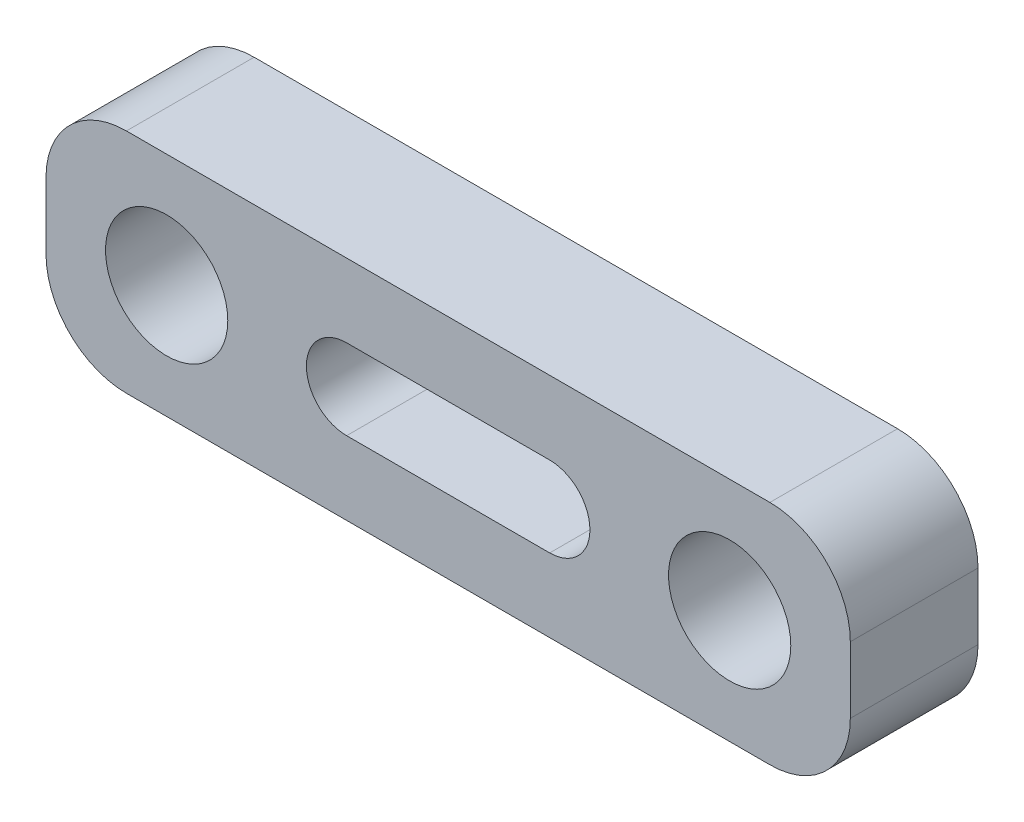
ISO-10303-21;
HEADER;
FILE_DESCRIPTION(('STEP AP214'),'2;1');
FILE_NAME('part.step','',(''),(''),'','','');
FILE_SCHEMA(('AUTOMOTIVE_DESIGN { 1 0 10303 214 1 1 1 1 }'));
ENDSEC;
DATA;
#1=APPLICATION_CONTEXT('core data for automotive mechanical design processes');
#2=APPLICATION_PROTOCOL_DEFINITION('international standard','automotive_design',2000,#1);
#3=PRODUCT_CONTEXT('',#1,'mechanical');
#4=PRODUCT('Part','Part','',(#3));
#5=PRODUCT_RELATED_PRODUCT_CATEGORY('part','',(#4));
#6=PRODUCT_DEFINITION_FORMATION('','',#4);
#7=PRODUCT_DEFINITION_CONTEXT('part definition',#1,'design');
#8=PRODUCT_DEFINITION('design','',#6,#7);
#9=PRODUCT_DEFINITION_SHAPE('','',#8);
#10=(LENGTH_UNIT() NAMED_UNIT(*) SI_UNIT(.MILLI.,.METRE.));
#11=(NAMED_UNIT(*) PLANE_ANGLE_UNIT() SI_UNIT($,.RADIAN.));
#12=(NAMED_UNIT(*) SI_UNIT($,.STERADIAN.) SOLID_ANGLE_UNIT());
#13=UNCERTAINTY_MEASURE_WITH_UNIT(LENGTH_MEASURE(1.E-05),#10,'distance_accuracy_value','');
#14=(GEOMETRIC_REPRESENTATION_CONTEXT(3) GLOBAL_UNCERTAINTY_ASSIGNED_CONTEXT((#13)) GLOBAL_UNIT_ASSIGNED_CONTEXT((#10,
#11,#12)) REPRESENTATION_CONTEXT('',''));
#15=CARTESIAN_POINT('',(0.,0.,0.));
#16=DIRECTION('',(0.,0.,1.));
#17=DIRECTION('',(1.,0.,0.));
#18=AXIS2_PLACEMENT_3D('',#15,#16,#17);
#19=CARTESIAN_POINT('',(10.,-2.825,3.175));
#20=DIRECTION('',(-1.,0.,0.));
#21=DIRECTION('',(0.,0.,1.));
#22=AXIS2_PLACEMENT_3D('',#19,#20,#21);
#23=PLANE('',#22);
#24=DIRECTION('',(0.,1.,0.));
#25=VECTOR('',#24,1.);
#26=CARTESIAN_POINT('',(10.,-2.825,3.175));
#27=LINE('',#26,#25);
#28=CARTESIAN_POINT('',(10.,-0.825000000000001,3.175));
#29=VERTEX_POINT('',#28);
#30=CARTESIAN_POINT('',(10.,0.825000000000001,3.175));
#31=VERTEX_POINT('',#30);
#32=EDGE_CURVE('E163',#29,#31,#27,.T.);
#33=ORIENTED_EDGE('',*,*,#32,.F.);
#34=DIRECTION('',(0.,0.,-1.));
#35=VECTOR('',#34,1.);
#36=CARTESIAN_POINT('',(10.,-0.825000000000001,3.175));
#37=LINE('',#36,#35);
#38=CARTESIAN_POINT('',(10.,-0.825000000000001,0.));
#39=VERTEX_POINT('',#38);
#40=EDGE_CURVE('E188',#29,#39,#37,.T.);
#41=ORIENTED_EDGE('',*,*,#40,.T.);
#42=DIRECTION('',(0.,1.,0.));
#43=VECTOR('',#42,1.);
#44=CARTESIAN_POINT('',(10.,-2.825,0.));
#45=LINE('',#44,#43);
#46=CARTESIAN_POINT('',(10.,0.825000000000001,0.));
#47=VERTEX_POINT('',#46);
#48=EDGE_CURVE('E159',#39,#47,#45,.T.);
#49=ORIENTED_EDGE('',*,*,#48,.T.);
#50=DIRECTION('',(0.,0.,-1.));
#51=VECTOR('',#50,1.);
#52=CARTESIAN_POINT('',(10.,0.825000000000001,3.175));
#53=LINE('',#52,#51);
#54=EDGE_CURVE('E176',#47,#31,#53,.F.);
#55=ORIENTED_EDGE('',*,*,#54,.T.);
#56=EDGE_LOOP('',(#33,#41,#49,#55));
#57=FACE_BOUND('',#56,.T.);
#58=ADVANCED_FACE('F34',(#57),#23,.F.);
#59=CARTESIAN_POINT('',(-10.,2.825,3.175));
#60=DIRECTION('',(0.,-1.,0.));
#61=DIRECTION('',(0.,0.,-1.));
#62=AXIS2_PLACEMENT_3D('',#59,#60,#61);
#63=PLANE('',#62);
#64=DIRECTION('',(-1.,0.,0.));
#65=VECTOR('',#64,1.);
#66=CARTESIAN_POINT('',(-10.,2.825,3.175));
#67=LINE('',#66,#65);
#68=CARTESIAN_POINT('',(8.,2.825,3.175));
#69=VERTEX_POINT('',#68);
#70=CARTESIAN_POINT('',(-8.,2.825,3.175));
#71=VERTEX_POINT('',#70);
#72=EDGE_CURVE('E166',#69,#71,#67,.T.);
#73=ORIENTED_EDGE('',*,*,#72,.F.);
#74=DIRECTION('',(0.,0.,-1.));
#75=VECTOR('',#74,1.);
#76=CARTESIAN_POINT('',(8.,2.825,3.175));
#77=LINE('',#76,#75);
#78=CARTESIAN_POINT('',(8.,2.825,0.));
#79=VERTEX_POINT('',#78);
#80=EDGE_CURVE('E214',#69,#79,#77,.T.);
#81=ORIENTED_EDGE('',*,*,#80,.T.);
#82=DIRECTION('',(-1.,0.,0.));
#83=VECTOR('',#82,1.);
#84=CARTESIAN_POINT('',(-10.,2.825,0.));
#85=LINE('',#84,#83);
#86=CARTESIAN_POINT('',(-8.,2.825,0.));
#87=VERTEX_POINT('',#86);
#88=EDGE_CURVE('E179',#79,#87,#85,.T.);
#89=ORIENTED_EDGE('',*,*,#88,.T.);
#90=DIRECTION('',(0.,0.,-1.));
#91=VECTOR('',#90,1.);
#92=CARTESIAN_POINT('',(-8.,2.825,3.175));
#93=LINE('',#92,#91);
#94=EDGE_CURVE('E212',#87,#71,#93,.F.);
#95=ORIENTED_EDGE('',*,*,#94,.T.);
#96=EDGE_LOOP('',(#73,#81,#89,#95));
#97=FACE_BOUND('',#96,.T.);
#98=ADVANCED_FACE('F251',(#97),#63,.F.);
#99=CARTESIAN_POINT('',(-10.,-2.825,3.175));
#100=DIRECTION('',(1.,0.,0.));
#101=DIRECTION('',(0.,0.,-1.));
#102=AXIS2_PLACEMENT_3D('',#99,#100,#101);
#103=PLANE('',#102);
#104=DIRECTION('',(0.,-1.,0.));
#105=VECTOR('',#104,1.);
#106=CARTESIAN_POINT('',(-10.,-2.825,0.));
#107=LINE('',#106,#105);
#108=CARTESIAN_POINT('',(-10.,0.825000000000001,0.));
#109=VERTEX_POINT('',#108);
#110=CARTESIAN_POINT('',(-10.,-0.825000000000001,0.));
#111=VERTEX_POINT('',#110);
#112=EDGE_CURVE('E182',#109,#111,#107,.T.);
#113=ORIENTED_EDGE('',*,*,#112,.T.);
#114=DIRECTION('',(0.,0.,-1.));
#115=VECTOR('',#114,1.);
#116=CARTESIAN_POINT('',(-10.,-0.825000000000001,3.175));
#117=LINE('',#116,#115);
#118=CARTESIAN_POINT('',(-10.,-0.825000000000001,3.175));
#119=VERTEX_POINT('',#118);
#120=EDGE_CURVE('E11',#111,#119,#117,.F.);
#121=ORIENTED_EDGE('',*,*,#120,.T.);
#122=DIRECTION('',(0.,-1.,0.));
#123=VECTOR('',#122,1.);
#124=CARTESIAN_POINT('',(-10.,-2.825,3.175));
#125=LINE('',#124,#123);
#126=CARTESIAN_POINT('',(-10.,0.825000000000001,3.175));
#127=VERTEX_POINT('',#126);
#128=EDGE_CURVE('E170',#127,#119,#125,.T.);
#129=ORIENTED_EDGE('',*,*,#128,.F.);
#130=DIRECTION('',(0.,0.,-1.));
#131=VECTOR('',#130,1.);
#132=CARTESIAN_POINT('',(-10.,0.825000000000001,3.175));
#133=LINE('',#132,#131);
#134=EDGE_CURVE('E42',#127,#109,#133,.T.);
#135=ORIENTED_EDGE('',*,*,#134,.T.);
#136=EDGE_LOOP('',(#113,#121,#129,#135));
#137=FACE_BOUND('',#136,.T.);
#138=ADVANCED_FACE('F221',(#137),#103,.F.);
#139=CARTESIAN_POINT('',(-10.,-2.825,3.175));
#140=DIRECTION('',(0.,1.,0.));
#141=DIRECTION('',(0.,0.,1.));
#142=AXIS2_PLACEMENT_3D('',#139,#140,#141);
#143=PLANE('',#142);
#144=DIRECTION('',(1.,0.,0.));
#145=VECTOR('',#144,1.);
#146=CARTESIAN_POINT('',(-10.,-2.825,0.));
#147=LINE('',#146,#145);
#148=CARTESIAN_POINT('',(-8.,-2.825,0.));
#149=VERTEX_POINT('',#148);
#150=CARTESIAN_POINT('',(8.,-2.825,0.));
#151=VERTEX_POINT('',#150);
#152=EDGE_CURVE('E167',#149,#151,#147,.T.);
#153=ORIENTED_EDGE('',*,*,#152,.T.);
#154=DIRECTION('',(0.,0.,-1.));
#155=VECTOR('',#154,1.);
#156=CARTESIAN_POINT('',(8.,-2.825,3.175));
#157=LINE('',#156,#155);
#158=CARTESIAN_POINT('',(8.,-2.825,3.175));
#159=VERTEX_POINT('',#158);
#160=EDGE_CURVE('E202',#151,#159,#157,.F.);
#161=ORIENTED_EDGE('',*,*,#160,.T.);
#162=DIRECTION('',(1.,0.,0.));
#163=VECTOR('',#162,1.);
#164=CARTESIAN_POINT('',(-10.,-2.825,3.175));
#165=LINE('',#164,#163);
#166=CARTESIAN_POINT('',(-8.,-2.825,3.175));
#167=VERTEX_POINT('',#166);
#168=EDGE_CURVE('E173',#167,#159,#165,.T.);
#169=ORIENTED_EDGE('',*,*,#168,.F.);
#170=DIRECTION('',(0.,0.,-1.));
#171=VECTOR('',#170,1.);
#172=CARTESIAN_POINT('',(-8.,-2.825,3.175));
#173=LINE('',#172,#171);
#174=EDGE_CURVE('E199',#167,#149,#173,.T.);
#175=ORIENTED_EDGE('',*,*,#174,.T.);
#176=EDGE_LOOP('',(#153,#161,#169,#175));
#177=FACE_BOUND('',#176,.T.);
#178=ADVANCED_FACE('F234',(#177),#143,.F.);
#179=CARTESIAN_POINT('',(0.,0.,3.175));
#180=DIRECTION('',(0.,0.,-1.));
#181=DIRECTION('',(-1.,0.,0.));
#182=AXIS2_PLACEMENT_3D('',#179,#180,#181);
#183=PLANE('',#182);
#184=CARTESIAN_POINT('',(7.,0.,3.175));
#185=DIRECTION('',(0.,0.,1.));
#186=DIRECTION('',(1.,0.,0.));
#187=AXIS2_PLACEMENT_3D('',#184,#185,#186);
#188=CIRCLE('',#187,1.52);
#189=CARTESIAN_POINT('',(8.52,0.,3.175));
#190=VERTEX_POINT('',#189);
#191=EDGE_CURVE('E146',#190,#190,#188,.T.);
#192=ORIENTED_EDGE('',*,*,#191,.F.);
#193=EDGE_LOOP('',(#192));
#194=FACE_BOUND('',#193,.T.);
#195=CARTESIAN_POINT('',(-7.,0.,3.175));
#196=DIRECTION('',(0.,0.,1.));
#197=DIRECTION('',(1.,0.,0.));
#198=AXIS2_PLACEMENT_3D('',#195,#196,#197);
#199=CIRCLE('',#198,1.52);
#200=CARTESIAN_POINT('',(-5.48,0.,3.175));
#201=VERTEX_POINT('',#200);
#202=EDGE_CURVE('E394',#201,#201,#199,.T.);
#203=ORIENTED_EDGE('',*,*,#202,.F.);
#204=EDGE_LOOP('',(#203));
#205=FACE_BOUND('',#204,.T.);
#206=DIRECTION('',(1.,0.,0.));
#207=VECTOR('',#206,1.);
#208=CARTESIAN_POINT('',(-2.525,-0.999999999999999,3.175));
#209=LINE('',#208,#207);
#210=CARTESIAN_POINT('',(-2.525,-0.999999999999999,3.175));
#211=VERTEX_POINT('',#210);
#212=CARTESIAN_POINT('',(2.525,-0.999999999999999,3.175));
#213=VERTEX_POINT('',#212);
#214=EDGE_CURVE('E152',#211,#213,#209,.T.);
#215=ORIENTED_EDGE('',*,*,#214,.F.);
#216=CARTESIAN_POINT('',(-2.525,0.,3.175));
#217=DIRECTION('',(0.,0.,1.));
#218=DIRECTION('',(1.,0.,0.));
#219=AXIS2_PLACEMENT_3D('',#216,#217,#218);
#220=CIRCLE('',#219,0.999999999999999);
#221=CARTESIAN_POINT('',(-2.525,0.999999999999999,3.175));
#222=VERTEX_POINT('',#221);
#223=EDGE_CURVE('E49',#222,#211,#220,.T.);
#224=ORIENTED_EDGE('',*,*,#223,.F.);
#225=DIRECTION('',(-1.,0.,0.));
#226=VECTOR('',#225,1.);
#227=CARTESIAN_POINT('',(-2.525,0.999999999999999,3.175));
#228=LINE('',#227,#226);
#229=CARTESIAN_POINT('',(2.525,0.999999999999999,3.175));
#230=VERTEX_POINT('',#229);
#231=EDGE_CURVE('E140',#230,#222,#228,.T.);
#232=ORIENTED_EDGE('',*,*,#231,.F.);
#233=CARTESIAN_POINT('',(2.525,0.,3.175));
#234=DIRECTION('',(0.,0.,1.));
#235=DIRECTION('',(1.,0.,0.));
#236=AXIS2_PLACEMENT_3D('',#233,#234,#235);
#237=CIRCLE('',#236,0.999999999999999);
#238=EDGE_CURVE('E143',#213,#230,#237,.T.);
#239=ORIENTED_EDGE('',*,*,#238,.F.);
#240=EDGE_LOOP('',(#215,#224,#232,#239));
#241=FACE_BOUND('',#240,.T.);
#242=ORIENTED_EDGE('',*,*,#168,.T.);
#243=CARTESIAN_POINT('',(8.,-0.825000000000001,3.175));
#244=DIRECTION('',(0.,0.,-1.));
#245=DIRECTION('',(-1.,0.,0.));
#246=AXIS2_PLACEMENT_3D('',#243,#244,#245);
#247=CIRCLE('',#246,2.);
#248=EDGE_CURVE('E210',#159,#29,#247,.F.);
#249=ORIENTED_EDGE('',*,*,#248,.T.);
#250=ORIENTED_EDGE('',*,*,#32,.T.);
#251=CARTESIAN_POINT('',(8.,0.825000000000001,3.175));
#252=DIRECTION('',(0.,0.,-1.));
#253=DIRECTION('',(-1.,0.,0.));
#254=AXIS2_PLACEMENT_3D('',#251,#252,#253);
#255=CIRCLE('',#254,2.);
#256=EDGE_CURVE('E208',#31,#69,#255,.F.);
#257=ORIENTED_EDGE('',*,*,#256,.T.);
#258=ORIENTED_EDGE('',*,*,#72,.T.);
#259=CARTESIAN_POINT('',(-8.,0.825000000000001,3.175));
#260=DIRECTION('',(0.,0.,-1.));
#261=DIRECTION('',(-1.,0.,0.));
#262=AXIS2_PLACEMENT_3D('',#259,#260,#261);
#263=CIRCLE('',#262,2.);
#264=EDGE_CURVE('E204',#71,#127,#263,.F.);
#265=ORIENTED_EDGE('',*,*,#264,.T.);
#266=ORIENTED_EDGE('',*,*,#128,.T.);
#267=CARTESIAN_POINT('',(-8.,-0.825000000000001,3.175));
#268=DIRECTION('',(0.,0.,-1.));
#269=DIRECTION('',(-1.,0.,0.));
#270=AXIS2_PLACEMENT_3D('',#267,#268,#269);
#271=CIRCLE('',#270,2.);
#272=EDGE_CURVE('E206',#119,#167,#271,.F.);
#273=ORIENTED_EDGE('',*,*,#272,.T.);
#274=EDGE_LOOP('',(#242,#249,#250,#257,#258,#265,#266,#273));
#275=FACE_BOUND('',#274,.T.);
#276=ADVANCED_FACE('F238',(#194,#205,#241,#275),#183,.F.);
#277=CARTESIAN_POINT('',(0.,0.,0.));
#278=DIRECTION('',(0.,0.,-1.));
#279=DIRECTION('',(-1.,0.,0.));
#280=AXIS2_PLACEMENT_3D('',#277,#278,#279);
#281=PLANE('',#280);
#282=CARTESIAN_POINT('',(7.,0.,0.));
#283=DIRECTION('',(0.,0.,1.));
#284=DIRECTION('',(1.,0.,0.));
#285=AXIS2_PLACEMENT_3D('',#282,#283,#284);
#286=CIRCLE('',#285,1.52);
#287=CARTESIAN_POINT('',(8.52,0.,0.));
#288=VERTEX_POINT('',#287);
#289=EDGE_CURVE('E391',#288,#288,#286,.T.);
#290=ORIENTED_EDGE('',*,*,#289,.T.);
#291=EDGE_LOOP('',(#290));
#292=FACE_BOUND('',#291,.T.);
#293=CARTESIAN_POINT('',(-7.,0.,0.));
#294=DIRECTION('',(0.,0.,1.));
#295=DIRECTION('',(1.,0.,0.));
#296=AXIS2_PLACEMENT_3D('',#293,#294,#295);
#297=CIRCLE('',#296,1.52);
#298=CARTESIAN_POINT('',(-5.48,0.,0.));
#299=VERTEX_POINT('',#298);
#300=EDGE_CURVE('E153',#299,#299,#297,.T.);
#301=ORIENTED_EDGE('',*,*,#300,.T.);
#302=EDGE_LOOP('',(#301));
#303=FACE_BOUND('',#302,.T.);
#304=CARTESIAN_POINT('',(-2.525,0.,0.));
#305=DIRECTION('',(0.,0.,1.));
#306=DIRECTION('',(1.,0.,0.));
#307=AXIS2_PLACEMENT_3D('',#304,#305,#306);
#308=CIRCLE('',#307,0.999999999999999);
#309=CARTESIAN_POINT('',(-2.525,0.999999999999999,0.));
#310=VERTEX_POINT('',#309);
#311=CARTESIAN_POINT('',(-2.525,-0.999999999999999,0.));
#312=VERTEX_POINT('',#311);
#313=EDGE_CURVE('E124',#310,#312,#308,.T.);
#314=ORIENTED_EDGE('',*,*,#313,.T.);
#315=DIRECTION('',(1.,0.,0.));
#316=VECTOR('',#315,1.);
#317=CARTESIAN_POINT('',(-2.525,-0.999999999999999,0.));
#318=LINE('',#317,#316);
#319=CARTESIAN_POINT('',(2.525,-0.999999999999999,0.));
#320=VERTEX_POINT('',#319);
#321=EDGE_CURVE('E133',#312,#320,#318,.T.);
#322=ORIENTED_EDGE('',*,*,#321,.T.);
#323=CARTESIAN_POINT('',(2.525,0.,0.));
#324=DIRECTION('',(0.,0.,1.));
#325=DIRECTION('',(1.,0.,0.));
#326=AXIS2_PLACEMENT_3D('',#323,#324,#325);
#327=CIRCLE('',#326,0.999999999999999);
#328=CARTESIAN_POINT('',(2.525,0.999999999999999,0.));
#329=VERTEX_POINT('',#328);
#330=EDGE_CURVE('E57',#320,#329,#327,.T.);
#331=ORIENTED_EDGE('',*,*,#330,.T.);
#332=DIRECTION('',(-1.,0.,0.));
#333=VECTOR('',#332,1.);
#334=CARTESIAN_POINT('',(-2.525,0.999999999999999,0.));
#335=LINE('',#334,#333);
#336=EDGE_CURVE('E130',#329,#310,#335,.T.);
#337=ORIENTED_EDGE('',*,*,#336,.T.);
#338=EDGE_LOOP('',(#314,#322,#331,#337));
#339=FACE_BOUND('',#338,.T.);
#340=ORIENTED_EDGE('',*,*,#48,.F.);
#341=CARTESIAN_POINT('',(8.,-0.825000000000001,0.));
#342=DIRECTION('',(0.,0.,-1.));
#343=DIRECTION('',(-1.,0.,0.));
#344=AXIS2_PLACEMENT_3D('',#341,#342,#343);
#345=CIRCLE('',#344,2.);
#346=EDGE_CURVE('E197',#39,#151,#345,.T.);
#347=ORIENTED_EDGE('',*,*,#346,.T.);
#348=ORIENTED_EDGE('',*,*,#152,.F.);
#349=CARTESIAN_POINT('',(-8.,-0.825000000000001,0.));
#350=DIRECTION('',(0.,0.,-1.));
#351=DIRECTION('',(-1.,0.,0.));
#352=AXIS2_PLACEMENT_3D('',#349,#350,#351);
#353=CIRCLE('',#352,2.);
#354=EDGE_CURVE('E193',#149,#111,#353,.T.);
#355=ORIENTED_EDGE('',*,*,#354,.T.);
#356=ORIENTED_EDGE('',*,*,#112,.F.);
#357=CARTESIAN_POINT('',(-8.,0.825000000000001,0.));
#358=DIRECTION('',(0.,0.,-1.));
#359=DIRECTION('',(-1.,0.,0.));
#360=AXIS2_PLACEMENT_3D('',#357,#358,#359);
#361=CIRCLE('',#360,2.);
#362=EDGE_CURVE('E191',#109,#87,#361,.T.);
#363=ORIENTED_EDGE('',*,*,#362,.T.);
#364=ORIENTED_EDGE('',*,*,#88,.F.);
#365=CARTESIAN_POINT('',(8.,0.825000000000001,0.));
#366=DIRECTION('',(0.,0.,-1.));
#367=DIRECTION('',(-1.,0.,0.));
#368=AXIS2_PLACEMENT_3D('',#365,#366,#367);
#369=CIRCLE('',#368,2.);
#370=EDGE_CURVE('E195',#79,#47,#369,.T.);
#371=ORIENTED_EDGE('',*,*,#370,.T.);
#372=EDGE_LOOP('',(#340,#347,#348,#355,#356,#363,#364,#371));
#373=FACE_BOUND('',#372,.T.);
#374=ADVANCED_FACE('F137',(#292,#303,#339,#373),#281,.T.);
#375=CARTESIAN_POINT('',(8.,-0.825000000000001,3.175));
#376=DIRECTION('',(0.,0.,-1.));
#377=DIRECTION('',(-1.,0.,0.));
#378=AXIS2_PLACEMENT_3D('',#375,#376,#377);
#379=CYLINDRICAL_SURFACE('',#378,2.);
#380=ORIENTED_EDGE('',*,*,#248,.F.);
#381=ORIENTED_EDGE('',*,*,#160,.F.);
#382=ORIENTED_EDGE('',*,*,#346,.F.);
#383=ORIENTED_EDGE('',*,*,#40,.F.);
#384=EDGE_LOOP('',(#380,#381,#382,#383));
#385=FACE_BOUND('',#384,.T.);
#386=ADVANCED_FACE('F242',(#385),#379,.T.);
#387=CARTESIAN_POINT('',(8.,0.825000000000001,3.175));
#388=DIRECTION('',(0.,0.,-1.));
#389=DIRECTION('',(-1.,0.,0.));
#390=AXIS2_PLACEMENT_3D('',#387,#388,#389);
#391=CYLINDRICAL_SURFACE('',#390,2.);
#392=ORIENTED_EDGE('',*,*,#256,.F.);
#393=ORIENTED_EDGE('',*,*,#54,.F.);
#394=ORIENTED_EDGE('',*,*,#370,.F.);
#395=ORIENTED_EDGE('',*,*,#80,.F.);
#396=EDGE_LOOP('',(#392,#393,#394,#395));
#397=FACE_BOUND('',#396,.T.);
#398=ADVANCED_FACE('F248',(#397),#391,.T.);
#399=CARTESIAN_POINT('',(-8.,-0.825000000000001,3.175));
#400=DIRECTION('',(0.,0.,-1.));
#401=DIRECTION('',(-1.,0.,0.));
#402=AXIS2_PLACEMENT_3D('',#399,#400,#401);
#403=CYLINDRICAL_SURFACE('',#402,2.);
#404=ORIENTED_EDGE('',*,*,#272,.F.);
#405=ORIENTED_EDGE('',*,*,#120,.F.);
#406=ORIENTED_EDGE('',*,*,#354,.F.);
#407=ORIENTED_EDGE('',*,*,#174,.F.);
#408=EDGE_LOOP('',(#404,#405,#406,#407));
#409=FACE_BOUND('',#408,.T.);
#410=ADVANCED_FACE('F231',(#409),#403,.T.);
#411=CARTESIAN_POINT('',(-8.,0.825000000000001,3.175));
#412=DIRECTION('',(0.,0.,-1.));
#413=DIRECTION('',(-1.,0.,0.));
#414=AXIS2_PLACEMENT_3D('',#411,#412,#413);
#415=CYLINDRICAL_SURFACE('',#414,2.);
#416=ORIENTED_EDGE('',*,*,#264,.F.);
#417=ORIENTED_EDGE('',*,*,#94,.F.);
#418=ORIENTED_EDGE('',*,*,#362,.F.);
#419=ORIENTED_EDGE('',*,*,#134,.F.);
#420=EDGE_LOOP('',(#416,#417,#418,#419));
#421=FACE_BOUND('',#420,.T.);
#422=ADVANCED_FACE('F36',(#421),#415,.T.);
#423=CARTESIAN_POINT('',(-2.525,0.,0.));
#424=DIRECTION('',(0.,0.,1.));
#425=DIRECTION('',(1.,0.,0.));
#426=AXIS2_PLACEMENT_3D('',#423,#424,#425);
#427=CYLINDRICAL_SURFACE('',#426,0.999999999999999);
#428=ORIENTED_EDGE('',*,*,#223,.T.);
#429=DIRECTION('',(0.,0.,1.));
#430=VECTOR('',#429,1.);
#431=CARTESIAN_POINT('',(-2.525,-0.999999999999999,0.));
#432=LINE('',#431,#430);
#433=EDGE_CURVE('E120',#312,#211,#432,.T.);
#434=ORIENTED_EDGE('',*,*,#433,.F.);
#435=ORIENTED_EDGE('',*,*,#313,.F.);
#436=DIRECTION('',(0.,0.,1.));
#437=VECTOR('',#436,1.);
#438=CARTESIAN_POINT('',(-2.525,0.999999999999999,0.));
#439=LINE('',#438,#437);
#440=EDGE_CURVE('E157',#310,#222,#439,.T.);
#441=ORIENTED_EDGE('',*,*,#440,.T.);
#442=EDGE_LOOP('',(#428,#434,#435,#441));
#443=FACE_BOUND('',#442,.T.);
#444=ADVANCED_FACE('F122',(#443),#427,.F.);
#445=CARTESIAN_POINT('',(-2.525,0.999999999999999,0.));
#446=DIRECTION('',(0.,1.,0.));
#447=DIRECTION('',(0.,0.,1.));
#448=AXIS2_PLACEMENT_3D('',#445,#446,#447);
#449=PLANE('',#448);
#450=ORIENTED_EDGE('',*,*,#231,.T.);
#451=ORIENTED_EDGE('',*,*,#440,.F.);
#452=ORIENTED_EDGE('',*,*,#336,.F.);
#453=DIRECTION('',(0.,0.,1.));
#454=VECTOR('',#453,1.);
#455=CARTESIAN_POINT('',(2.525,0.999999999999999,0.));
#456=LINE('',#455,#454);
#457=EDGE_CURVE('E160',#329,#230,#456,.T.);
#458=ORIENTED_EDGE('',*,*,#457,.T.);
#459=EDGE_LOOP('',(#450,#451,#452,#458));
#460=FACE_BOUND('',#459,.T.);
#461=ADVANCED_FACE('F258',(#460),#449,.F.);
#462=CARTESIAN_POINT('',(2.525,0.,0.));
#463=DIRECTION('',(0.,0.,1.));
#464=DIRECTION('',(1.,0.,0.));
#465=AXIS2_PLACEMENT_3D('',#462,#463,#464);
#466=CYLINDRICAL_SURFACE('',#465,0.999999999999999);
#467=ORIENTED_EDGE('',*,*,#238,.T.);
#468=ORIENTED_EDGE('',*,*,#457,.F.);
#469=ORIENTED_EDGE('',*,*,#330,.F.);
#470=DIRECTION('',(0.,0.,1.));
#471=VECTOR('',#470,1.);
#472=CARTESIAN_POINT('',(2.525,-0.999999999999999,0.));
#473=LINE('',#472,#471);
#474=EDGE_CURVE('E129',#320,#213,#473,.T.);
#475=ORIENTED_EDGE('',*,*,#474,.T.);
#476=EDGE_LOOP('',(#467,#468,#469,#475));
#477=FACE_BOUND('',#476,.T.);
#478=ADVANCED_FACE('F319',(#477),#466,.F.);
#479=CARTESIAN_POINT('',(-2.525,-0.999999999999999,0.));
#480=DIRECTION('',(0.,-1.,0.));
#481=DIRECTION('',(0.,0.,-1.));
#482=AXIS2_PLACEMENT_3D('',#479,#480,#481);
#483=PLANE('',#482);
#484=ORIENTED_EDGE('',*,*,#214,.T.);
#485=ORIENTED_EDGE('',*,*,#474,.F.);
#486=ORIENTED_EDGE('',*,*,#321,.F.);
#487=ORIENTED_EDGE('',*,*,#433,.T.);
#488=EDGE_LOOP('',(#484,#485,#486,#487));
#489=FACE_BOUND('',#488,.T.);
#490=ADVANCED_FACE('F134',(#489),#483,.F.);
#491=CARTESIAN_POINT('',(-7.,0.,0.));
#492=DIRECTION('',(0.,0.,1.));
#493=DIRECTION('',(1.,0.,0.));
#494=AXIS2_PLACEMENT_3D('',#491,#492,#493);
#495=CYLINDRICAL_SURFACE('',#494,1.52);
#496=ORIENTED_EDGE('',*,*,#300,.F.);
#497=EDGE_LOOP('',(#496));
#498=FACE_BOUND('',#497,.T.);
#499=ORIENTED_EDGE('',*,*,#202,.T.);
#500=EDGE_LOOP('',(#499));
#501=FACE_BOUND('',#500,.T.);
#502=ADVANCED_FACE('F337',(#498,#501),#495,.F.);
#503=CARTESIAN_POINT('',(7.,0.,0.));
#504=DIRECTION('',(0.,0.,1.));
#505=DIRECTION('',(1.,0.,0.));
#506=AXIS2_PLACEMENT_3D('',#503,#504,#505);
#507=CYLINDRICAL_SURFACE('',#506,1.52);
#508=ORIENTED_EDGE('',*,*,#289,.F.);
#509=EDGE_LOOP('',(#508));
#510=FACE_BOUND('',#509,.T.);
#511=ORIENTED_EDGE('',*,*,#191,.T.);
#512=EDGE_LOOP('',(#511));
#513=FACE_BOUND('',#512,.T.);
#514=ADVANCED_FACE('F346',(#510,#513),#507,.F.);
#515=CLOSED_SHELL('',(#58,#98,#138,#178,#276,#374,#386,#398,#410,#422,#444,#461,#478,#490,#502,#514));
#516=MANIFOLD_SOLID_BREP('B2',#515);
#517=ADVANCED_BREP_SHAPE_REPRESENTATION('',(#18,#516),#14);
#518=SHAPE_DEFINITION_REPRESENTATION(#9,#517);
ENDSEC;
END-ISO-10303-21;
